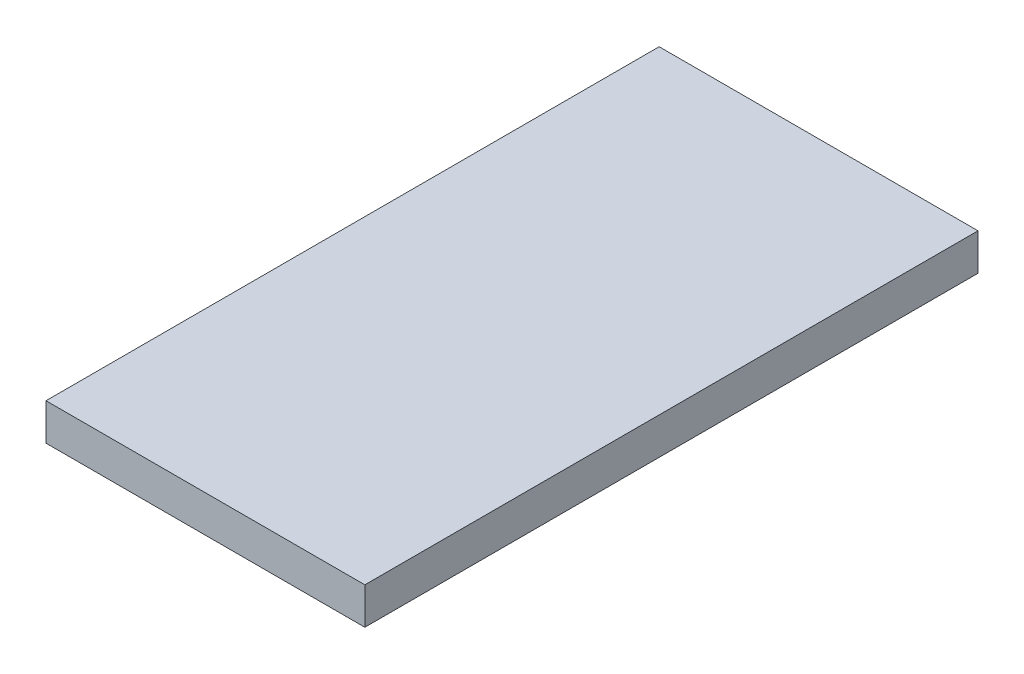
ISO-10303-21;
HEADER;
FILE_DESCRIPTION(('STEP AP214'),'2;1');
FILE_NAME('part.step','',(''),(''),'','','');
FILE_SCHEMA(('AUTOMOTIVE_DESIGN { 1 0 10303 214 1 1 1 1 }'));
ENDSEC;
DATA;
#1=APPLICATION_CONTEXT('core data for automotive mechanical design processes');
#2=APPLICATION_PROTOCOL_DEFINITION('international standard','automotive_design',2000,#1);
#3=PRODUCT_CONTEXT('',#1,'mechanical');
#4=PRODUCT('Part','Part','',(#3));
#5=PRODUCT_RELATED_PRODUCT_CATEGORY('part','',(#4));
#6=PRODUCT_DEFINITION_FORMATION('','',#4);
#7=PRODUCT_DEFINITION_CONTEXT('part definition',#1,'design');
#8=PRODUCT_DEFINITION('design','',#6,#7);
#9=PRODUCT_DEFINITION_SHAPE('','',#8);
#10=(LENGTH_UNIT() NAMED_UNIT(*) SI_UNIT(.MILLI.,.METRE.));
#11=(NAMED_UNIT(*) PLANE_ANGLE_UNIT() SI_UNIT($,.RADIAN.));
#12=(NAMED_UNIT(*) SI_UNIT($,.STERADIAN.) SOLID_ANGLE_UNIT());
#13=UNCERTAINTY_MEASURE_WITH_UNIT(LENGTH_MEASURE(1.E-05),#10,'distance_accuracy_value','');
#14=(GEOMETRIC_REPRESENTATION_CONTEXT(3) GLOBAL_UNCERTAINTY_ASSIGNED_CONTEXT((#13)) GLOBAL_UNIT_ASSIGNED_CONTEXT((#10,
#11,#12)) REPRESENTATION_CONTEXT('',''));
#15=CARTESIAN_POINT('',(0.,0.,0.));
#16=DIRECTION('',(0.,0.,1.));
#17=DIRECTION('',(1.,0.,0.));
#18=AXIS2_PLACEMENT_3D('',#15,#16,#17);
#19=CARTESIAN_POINT('',(0.,3.,0.));
#20=DIRECTION('',(1.,0.,0.));
#21=DIRECTION('',(0.,0.,-1.));
#22=AXIS2_PLACEMENT_3D('',#19,#20,#21);
#23=PLANE('',#22);
#24=DIRECTION('',(0.,0.,1.));
#25=VECTOR('',#24,1.);
#26=CARTESIAN_POINT('',(0.,0.,0.));
#27=LINE('',#26,#25);
#28=CARTESIAN_POINT('',(0.,0.,-50.));
#29=VERTEX_POINT('',#28);
#30=CARTESIAN_POINT('',(0.,0.,0.));
#31=VERTEX_POINT('',#30);
#32=EDGE_CURVE('E98',#29,#31,#27,.T.);
#33=ORIENTED_EDGE('',*,*,#32,.T.);
#34=DIRECTION('',(0.,-1.,0.));
#35=VECTOR('',#34,1.);
#36=CARTESIAN_POINT('',(0.,3.,0.));
#37=LINE('',#36,#35);
#38=CARTESIAN_POINT('',(0.,3.,0.));
#39=VERTEX_POINT('',#38);
#40=EDGE_CURVE('E11',#39,#31,#37,.T.);
#41=ORIENTED_EDGE('',*,*,#40,.F.);
#42=DIRECTION('',(0.,0.,1.));
#43=VECTOR('',#42,1.);
#44=CARTESIAN_POINT('',(0.,3.,0.));
#45=LINE('',#44,#43);
#46=CARTESIAN_POINT('',(0.,3.,-50.));
#47=VERTEX_POINT('',#46);
#48=EDGE_CURVE('E86',#47,#39,#45,.T.);
#49=ORIENTED_EDGE('',*,*,#48,.F.);
#50=DIRECTION('',(0.,-1.,0.));
#51=VECTOR('',#50,1.);
#52=CARTESIAN_POINT('',(0.,3.,-50.));
#53=LINE('',#52,#51);
#54=EDGE_CURVE('E94',#47,#29,#53,.T.);
#55=ORIENTED_EDGE('',*,*,#54,.T.);
#56=EDGE_LOOP('',(#33,#41,#49,#55));
#57=FACE_BOUND('',#56,.T.);
#58=ADVANCED_FACE('F35',(#57),#23,.F.);
#59=CARTESIAN_POINT('',(0.,3.,0.));
#60=DIRECTION('',(0.,0.,-1.));
#61=DIRECTION('',(-1.,0.,0.));
#62=AXIS2_PLACEMENT_3D('',#59,#60,#61);
#63=PLANE('',#62);
#64=DIRECTION('',(1.,0.,0.));
#65=VECTOR('',#64,1.);
#66=CARTESIAN_POINT('',(0.,0.,0.));
#67=LINE('',#66,#65);
#68=CARTESIAN_POINT('',(26.,0.,0.));
#69=VERTEX_POINT('',#68);
#70=EDGE_CURVE('E90',#31,#69,#67,.T.);
#71=ORIENTED_EDGE('',*,*,#70,.T.);
#72=DIRECTION('',(0.,-1.,0.));
#73=VECTOR('',#72,1.);
#74=CARTESIAN_POINT('',(26.,3.,0.));
#75=LINE('',#74,#73);
#76=CARTESIAN_POINT('',(26.,3.,0.));
#77=VERTEX_POINT('',#76);
#78=EDGE_CURVE('E43',#77,#69,#75,.T.);
#79=ORIENTED_EDGE('',*,*,#78,.F.);
#80=DIRECTION('',(1.,0.,0.));
#81=VECTOR('',#80,1.);
#82=CARTESIAN_POINT('',(0.,3.,0.));
#83=LINE('',#82,#81);
#84=EDGE_CURVE('E81',#39,#77,#83,.T.);
#85=ORIENTED_EDGE('',*,*,#84,.F.);
#86=ORIENTED_EDGE('',*,*,#40,.T.);
#87=EDGE_LOOP('',(#71,#79,#85,#86));
#88=FACE_BOUND('',#87,.T.);
#89=ADVANCED_FACE('F89',(#88),#63,.F.);
#90=CARTESIAN_POINT('',(26.,3.,0.));
#91=DIRECTION('',(-1.,0.,0.));
#92=DIRECTION('',(0.,0.,1.));
#93=AXIS2_PLACEMENT_3D('',#90,#91,#92);
#94=PLANE('',#93);
#95=DIRECTION('',(0.,0.,-1.));
#96=VECTOR('',#95,1.);
#97=CARTESIAN_POINT('',(26.,0.,0.));
#98=LINE('',#97,#96);
#99=CARTESIAN_POINT('',(26.,0.,-50.));
#100=VERTEX_POINT('',#99);
#101=EDGE_CURVE('E68',#69,#100,#98,.T.);
#102=ORIENTED_EDGE('',*,*,#101,.T.);
#103=DIRECTION('',(0.,-1.,0.));
#104=VECTOR('',#103,1.);
#105=CARTESIAN_POINT('',(26.,3.,-50.));
#106=LINE('',#105,#104);
#107=CARTESIAN_POINT('',(26.,3.,-50.));
#108=VERTEX_POINT('',#107);
#109=EDGE_CURVE('E91',#108,#100,#106,.T.);
#110=ORIENTED_EDGE('',*,*,#109,.F.);
#111=DIRECTION('',(0.,0.,-1.));
#112=VECTOR('',#111,1.);
#113=CARTESIAN_POINT('',(26.,3.,0.));
#114=LINE('',#113,#112);
#115=EDGE_CURVE('E84',#77,#108,#114,.T.);
#116=ORIENTED_EDGE('',*,*,#115,.F.);
#117=ORIENTED_EDGE('',*,*,#78,.T.);
#118=EDGE_LOOP('',(#102,#110,#116,#117));
#119=FACE_BOUND('',#118,.T.);
#120=ADVANCED_FACE('F92',(#119),#94,.F.);
#121=CARTESIAN_POINT('',(0.,3.,-50.));
#122=DIRECTION('',(0.,0.,1.));
#123=DIRECTION('',(1.,0.,0.));
#124=AXIS2_PLACEMENT_3D('',#121,#122,#123);
#125=PLANE('',#124);
#126=DIRECTION('',(-1.,0.,0.));
#127=VECTOR('',#126,1.);
#128=CARTESIAN_POINT('',(0.,0.,-50.));
#129=LINE('',#128,#127);
#130=EDGE_CURVE('E74',#100,#29,#129,.T.);
#131=ORIENTED_EDGE('',*,*,#130,.T.);
#132=ORIENTED_EDGE('',*,*,#54,.F.);
#133=DIRECTION('',(-1.,0.,0.));
#134=VECTOR('',#133,1.);
#135=CARTESIAN_POINT('',(0.,3.,-50.));
#136=LINE('',#135,#134);
#137=EDGE_CURVE('E51',#108,#47,#136,.T.);
#138=ORIENTED_EDGE('',*,*,#137,.F.);
#139=ORIENTED_EDGE('',*,*,#109,.T.);
#140=EDGE_LOOP('',(#131,#132,#138,#139));
#141=FACE_BOUND('',#140,.T.);
#142=ADVANCED_FACE('F105',(#141),#125,.F.);
#143=CARTESIAN_POINT('',(0.,3.,0.));
#144=DIRECTION('',(0.,-1.,0.));
#145=DIRECTION('',(0.,0.,-1.));
#146=AXIS2_PLACEMENT_3D('',#143,#144,#145);
#147=PLANE('',#146);
#148=ORIENTED_EDGE('',*,*,#48,.T.);
#149=ORIENTED_EDGE('',*,*,#84,.T.);
#150=ORIENTED_EDGE('',*,*,#115,.T.);
#151=ORIENTED_EDGE('',*,*,#137,.T.);
#152=EDGE_LOOP('',(#148,#149,#150,#151));
#153=FACE_BOUND('',#152,.T.);
#154=ADVANCED_FACE('F82',(#153),#147,.F.);
#155=CARTESIAN_POINT('',(0.,0.,0.));
#156=DIRECTION('',(0.,-1.,0.));
#157=DIRECTION('',(0.,0.,-1.));
#158=AXIS2_PLACEMENT_3D('',#155,#156,#157);
#159=PLANE('',#158);
#160=ORIENTED_EDGE('',*,*,#32,.F.);
#161=ORIENTED_EDGE('',*,*,#130,.F.);
#162=ORIENTED_EDGE('',*,*,#101,.F.);
#163=ORIENTED_EDGE('',*,*,#70,.F.);
#164=EDGE_LOOP('',(#160,#161,#162,#163));
#165=FACE_BOUND('',#164,.T.);
#166=ADVANCED_FACE('F108',(#165),#159,.T.);
#167=CLOSED_SHELL('',(#58,#89,#120,#142,#154,#166));
#168=MANIFOLD_SOLID_BREP('B2',#167);
#169=ADVANCED_BREP_SHAPE_REPRESENTATION('',(#18,#168),#14);
#170=SHAPE_DEFINITION_REPRESENTATION(#9,#169);
ENDSEC;
END-ISO-10303-21;
